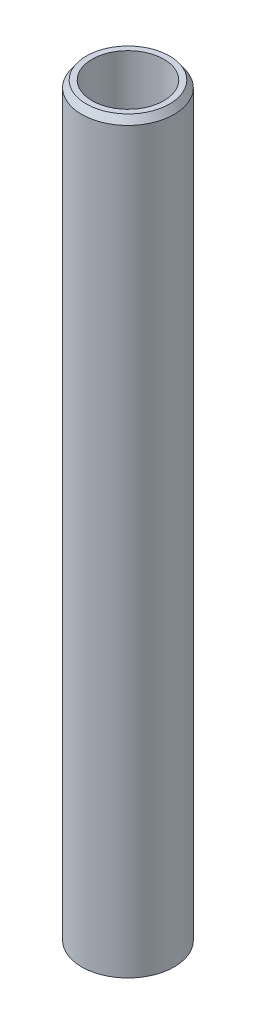
ISO-10303-21;
HEADER;
FILE_DESCRIPTION(('STEP AP214'),'2;1');
FILE_NAME('part.step','',(''),(''),'','','');
FILE_SCHEMA(('AUTOMOTIVE_DESIGN { 1 0 10303 214 1 1 1 1 }'));
ENDSEC;
DATA;
#1=APPLICATION_CONTEXT('core data for automotive mechanical design processes');
#2=APPLICATION_PROTOCOL_DEFINITION('international standard','automotive_design',2000,#1);
#3=PRODUCT_CONTEXT('',#1,'mechanical');
#4=PRODUCT('Part','Part','',(#3));
#5=PRODUCT_RELATED_PRODUCT_CATEGORY('part','',(#4));
#6=PRODUCT_DEFINITION_FORMATION('','',#4);
#7=PRODUCT_DEFINITION_CONTEXT('part definition',#1,'design');
#8=PRODUCT_DEFINITION('design','',#6,#7);
#9=PRODUCT_DEFINITION_SHAPE('','',#8);
#10=(LENGTH_UNIT() NAMED_UNIT(*) SI_UNIT(.MILLI.,.METRE.));
#11=(NAMED_UNIT(*) PLANE_ANGLE_UNIT() SI_UNIT($,.RADIAN.));
#12=(NAMED_UNIT(*) SI_UNIT($,.STERADIAN.) SOLID_ANGLE_UNIT());
#13=UNCERTAINTY_MEASURE_WITH_UNIT(LENGTH_MEASURE(1.E-05),#10,'distance_accuracy_value','');
#14=(GEOMETRIC_REPRESENTATION_CONTEXT(3) GLOBAL_UNCERTAINTY_ASSIGNED_CONTEXT((#13)) GLOBAL_UNIT_ASSIGNED_CONTEXT((#10,
#11,#12)) REPRESENTATION_CONTEXT('',''));
#15=CARTESIAN_POINT('',(0.,0.,0.));
#16=DIRECTION('',(0.,0.,1.));
#17=DIRECTION('',(1.,0.,0.));
#18=AXIS2_PLACEMENT_3D('',#15,#16,#17);
#19=CARTESIAN_POINT('',(0.,364.70965491064,0.));
#20=DIRECTION('',(0.,-1.,0.));
#21=DIRECTION('',(0.,0.,-1.));
#22=AXIS2_PLACEMENT_3D('',#19,#20,#21);
#23=CYLINDRICAL_SURFACE('',#22,22.5);
#24=CARTESIAN_POINT('',(0.,361.455560374161,0.));
#25=DIRECTION('',(0.,1.,0.));
#26=DIRECTION('',(0.,0.,1.));
#27=AXIS2_PLACEMENT_3D('',#24,#25,#26);
#28=CIRCLE('',#27,22.5);
#29=CARTESIAN_POINT('',(0.,361.455560374161,22.5));
#30=VERTEX_POINT('',#29);
#31=EDGE_CURVE('E50',#30,#30,#28,.F.);
#32=ORIENTED_EDGE('',*,*,#31,.T.);
#33=EDGE_LOOP('',(#32));
#34=FACE_BOUND('',#33,.T.);
#35=CARTESIAN_POINT('',(0.,2.2540097349838,0.));
#36=DIRECTION('',(0.,1.,0.));
#37=DIRECTION('',(0.,0.,1.));
#38=AXIS2_PLACEMENT_3D('',#35,#36,#37);
#39=CIRCLE('',#38,22.5);
#40=CARTESIAN_POINT('',(0.,2.2540097349838,22.5));
#41=VERTEX_POINT('',#40);
#42=EDGE_CURVE('E51',#41,#41,#39,.T.);
#43=ORIENTED_EDGE('',*,*,#42,.T.);
#44=EDGE_LOOP('',(#43));
#45=FACE_BOUND('',#44,.T.);
#46=ADVANCED_FACE('F39',(#34,#45),#23,.T.);
#47=CARTESIAN_POINT('',(0.,364.70965491064,0.));
#48=DIRECTION('',(0.,1.,0.));
#49=DIRECTION('',(0.,0.,1.));
#50=AXIS2_PLACEMENT_3D('',#47,#48,#49);
#51=PLANE('',#50);
#52=CARTESIAN_POINT('',(0.,364.70965491064,0.));
#53=DIRECTION('',(0.,1.,0.));
#54=DIRECTION('',(0.,0.,1.));
#55=AXIS2_PLACEMENT_3D('',#52,#53,#54);
#56=CIRCLE('',#55,20.2459902650162);
#57=CARTESIAN_POINT('',(0.,364.70965491064,20.2459902650162));
#58=VERTEX_POINT('',#57);
#59=EDGE_CURVE('E54',#58,#58,#56,.T.);
#60=ORIENTED_EDGE('',*,*,#59,.T.);
#61=EDGE_LOOP('',(#60));
#62=FACE_BOUND('',#61,.T.);
#63=CARTESIAN_POINT('',(0.,364.70965491064,0.));
#64=DIRECTION('',(0.,1.,0.));
#65=DIRECTION('',(0.,0.,1.));
#66=AXIS2_PLACEMENT_3D('',#63,#64,#65);
#67=CIRCLE('',#66,17.47846720642);
#68=CARTESIAN_POINT('',(0.,364.70965491064,17.47846720642));
#69=VERTEX_POINT('',#68);
#70=EDGE_CURVE('E58',#69,#69,#67,.T.);
#71=ORIENTED_EDGE('',*,*,#70,.F.);
#72=EDGE_LOOP('',(#71));
#73=FACE_BOUND('',#72,.T.);
#74=ADVANCED_FACE('F69',(#62,#73),#51,.T.);
#75=CARTESIAN_POINT('',(0.,0.,0.));
#76=DIRECTION('',(0.,1.,0.));
#77=DIRECTION('',(0.,0.,1.));
#78=AXIS2_PLACEMENT_3D('',#75,#76,#77);
#79=PLANE('',#78);
#80=CARTESIAN_POINT('',(0.,0.,0.));
#81=DIRECTION('',(0.,1.,0.));
#82=DIRECTION('',(0.,0.,1.));
#83=AXIS2_PLACEMENT_3D('',#80,#81,#82);
#84=CIRCLE('',#83,19.2459054635217);
#85=CARTESIAN_POINT('',(0.,0.,19.2459054635217));
#86=VERTEX_POINT('',#85);
#87=EDGE_CURVE('E10',#86,#86,#84,.F.);
#88=ORIENTED_EDGE('',*,*,#87,.T.);
#89=EDGE_LOOP('',(#88));
#90=FACE_BOUND('',#89,.T.);
#91=CARTESIAN_POINT('',(0.,0.,0.));
#92=DIRECTION('',(0.,1.,0.));
#93=DIRECTION('',(0.,0.,1.));
#94=AXIS2_PLACEMENT_3D('',#91,#92,#93);
#95=CIRCLE('',#94,17.47846720642);
#96=CARTESIAN_POINT('',(0.,0.,17.47846720642));
#97=VERTEX_POINT('',#96);
#98=EDGE_CURVE('E63',#97,#97,#95,.T.);
#99=ORIENTED_EDGE('',*,*,#98,.T.);
#100=EDGE_LOOP('',(#99));
#101=FACE_BOUND('',#100,.T.);
#102=ADVANCED_FACE('F75',(#90,#101),#79,.F.);
#103=CARTESIAN_POINT('',(0.,364.70965491064,0.));
#104=DIRECTION('',(0.,-1.,0.));
#105=DIRECTION('',(0.,0.,-1.));
#106=AXIS2_PLACEMENT_3D('',#103,#104,#105);
#107=CYLINDRICAL_SURFACE('',#106,17.47846720642);
#108=ORIENTED_EDGE('',*,*,#70,.T.);
#109=EDGE_LOOP('',(#108));
#110=FACE_BOUND('',#109,.T.);
#111=ORIENTED_EDGE('',*,*,#98,.F.);
#112=EDGE_LOOP('',(#111));
#113=FACE_BOUND('',#112,.T.);
#114=ADVANCED_FACE('F70',(#110,#113),#107,.F.);
#115=CARTESIAN_POINT('',(0.,364.70965491064,0.));
#116=DIRECTION('',(0.,-1.,0.));
#117=DIRECTION('',(0.,0.,-1.));
#118=AXIS2_PLACEMENT_3D('',#115,#116,#117);
#119=CONICAL_SURFACE('',#118,20.2459902650162,0.605788726442113);
#120=ORIENTED_EDGE('',*,*,#31,.F.);
#121=EDGE_LOOP('',(#120));
#122=FACE_BOUND('',#121,.T.);
#123=ORIENTED_EDGE('',*,*,#59,.F.);
#124=EDGE_LOOP('',(#123));
#125=FACE_BOUND('',#124,.T.);
#126=ADVANCED_FACE('F81',(#122,#125),#119,.T.);
#127=CARTESIAN_POINT('',(0.,2.2540097349838,0.));
#128=DIRECTION('',(0.,1.,0.));
#129=DIRECTION('',(0.,0.,1.));
#130=AXIS2_PLACEMENT_3D('',#127,#128,#129);
#131=CONICAL_SURFACE('',#130,22.5,0.965007600352791);
#132=ORIENTED_EDGE('',*,*,#87,.F.);
#133=EDGE_LOOP('',(#132));
#134=FACE_BOUND('',#133,.T.);
#135=ORIENTED_EDGE('',*,*,#42,.F.);
#136=EDGE_LOOP('',(#135));
#137=FACE_BOUND('',#136,.T.);
#138=ADVANCED_FACE('F45',(#134,#137),#131,.T.);
#139=CLOSED_SHELL('',(#46,#74,#102,#114,#126,#138));
#140=MANIFOLD_SOLID_BREP('B2',#139);
#141=ADVANCED_BREP_SHAPE_REPRESENTATION('',(#18,#140),#14);
#142=SHAPE_DEFINITION_REPRESENTATION(#9,#141);
ENDSEC;
END-ISO-10303-21;
